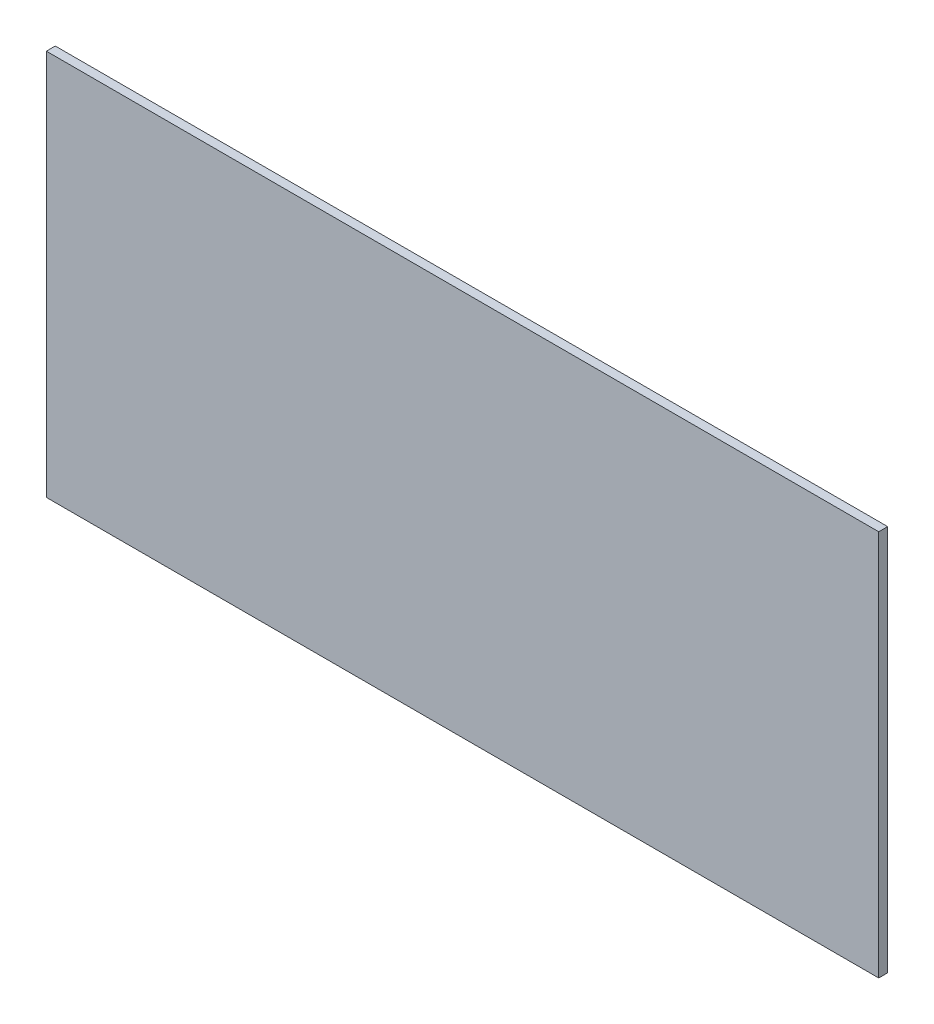
ISO-10303-21;
HEADER;
FILE_DESCRIPTION(('STEP AP214'),'2;1');
FILE_NAME('part.step','',(''),(''),'','','');
FILE_SCHEMA(('AUTOMOTIVE_DESIGN { 1 0 10303 214 1 1 1 1 }'));
ENDSEC;
DATA;
#1=APPLICATION_CONTEXT('core data for automotive mechanical design processes');
#2=APPLICATION_PROTOCOL_DEFINITION('international standard','automotive_design',2000,#1);
#3=PRODUCT_CONTEXT('',#1,'mechanical');
#4=PRODUCT('Part','Part','',(#3));
#5=PRODUCT_RELATED_PRODUCT_CATEGORY('part','',(#4));
#6=PRODUCT_DEFINITION_FORMATION('','',#4);
#7=PRODUCT_DEFINITION_CONTEXT('part definition',#1,'design');
#8=PRODUCT_DEFINITION('design','',#6,#7);
#9=PRODUCT_DEFINITION_SHAPE('','',#8);
#10=(LENGTH_UNIT() NAMED_UNIT(*) SI_UNIT(.MILLI.,.METRE.));
#11=(NAMED_UNIT(*) PLANE_ANGLE_UNIT() SI_UNIT($,.RADIAN.));
#12=(NAMED_UNIT(*) SI_UNIT($,.STERADIAN.) SOLID_ANGLE_UNIT());
#13=UNCERTAINTY_MEASURE_WITH_UNIT(LENGTH_MEASURE(1.E-05),#10,'distance_accuracy_value','');
#14=(GEOMETRIC_REPRESENTATION_CONTEXT(3) GLOBAL_UNCERTAINTY_ASSIGNED_CONTEXT((#13)) GLOBAL_UNIT_ASSIGNED_CONTEXT((#10,
#11,#12)) REPRESENTATION_CONTEXT('',''));
#15=CARTESIAN_POINT('',(0.,0.,0.));
#16=DIRECTION('',(0.,0.,1.));
#17=DIRECTION('',(1.,0.,0.));
#18=AXIS2_PLACEMENT_3D('',#15,#16,#17);
#19=CARTESIAN_POINT('',(-140.,643.088839573787,-3.));
#20=DIRECTION('',(0.,-1.,0.));
#21=DIRECTION('',(0.,0.,-1.));
#22=AXIS2_PLACEMENT_3D('',#19,#20,#21);
#23=PLANE('',#22);
#24=DIRECTION('',(1.,0.,0.));
#25=VECTOR('',#24,1.);
#26=CARTESIAN_POINT('',(-140.,643.088839573787,0.));
#27=LINE('',#26,#25);
#28=CARTESIAN_POINT('',(-140.,643.088839573787,0.));
#29=VERTEX_POINT('',#28);
#30=CARTESIAN_POINT('',(140.,643.088839573787,0.));
#31=VERTEX_POINT('',#30);
#32=EDGE_CURVE('E98',#29,#31,#27,.T.);
#33=ORIENTED_EDGE('',*,*,#32,.F.);
#34=DIRECTION('',(0.,0.,1.));
#35=VECTOR('',#34,1.);
#36=CARTESIAN_POINT('',(-140.,643.088839573787,-3.));
#37=LINE('',#36,#35);
#38=CARTESIAN_POINT('',(-140.,643.088839573787,-3.));
#39=VERTEX_POINT('',#38);
#40=EDGE_CURVE('E11',#39,#29,#37,.T.);
#41=ORIENTED_EDGE('',*,*,#40,.F.);
#42=DIRECTION('',(1.,0.,0.));
#43=VECTOR('',#42,1.);
#44=CARTESIAN_POINT('',(-140.,643.088839573787,-3.));
#45=LINE('',#44,#43);
#46=CARTESIAN_POINT('',(140.,643.088839573787,-3.));
#47=VERTEX_POINT('',#46);
#48=EDGE_CURVE('E92',#39,#47,#45,.T.);
#49=ORIENTED_EDGE('',*,*,#48,.T.);
#50=DIRECTION('',(0.,0.,1.));
#51=VECTOR('',#50,1.);
#52=CARTESIAN_POINT('',(140.,643.088839573787,-3.));
#53=LINE('',#52,#51);
#54=EDGE_CURVE('E37',#47,#31,#53,.T.);
#55=ORIENTED_EDGE('',*,*,#54,.T.);
#56=EDGE_LOOP('',(#33,#41,#49,#55));
#57=FACE_BOUND('',#56,.T.);
#58=ADVANCED_FACE('F34',(#57),#23,.T.);
#59=CARTESIAN_POINT('',(-140.,773.088839573787,-3.));
#60=DIRECTION('',(-1.,0.,0.));
#61=DIRECTION('',(0.,-1.,0.));
#62=AXIS2_PLACEMENT_3D('',#59,#60,#61);
#63=PLANE('',#62);
#64=DIRECTION('',(0.,-1.,0.));
#65=VECTOR('',#64,1.);
#66=CARTESIAN_POINT('',(-140.,773.088839573787,0.));
#67=LINE('',#66,#65);
#68=CARTESIAN_POINT('',(-140.,773.088839573787,0.));
#69=VERTEX_POINT('',#68);
#70=EDGE_CURVE('E94',#69,#29,#67,.T.);
#71=ORIENTED_EDGE('',*,*,#70,.F.);
#72=DIRECTION('',(0.,0.,1.));
#73=VECTOR('',#72,1.);
#74=CARTESIAN_POINT('',(-140.,773.088839573787,-3.));
#75=LINE('',#74,#73);
#76=CARTESIAN_POINT('',(-140.,773.088839573787,-3.));
#77=VERTEX_POINT('',#76);
#78=EDGE_CURVE('E43',#77,#69,#75,.T.);
#79=ORIENTED_EDGE('',*,*,#78,.F.);
#80=DIRECTION('',(0.,-1.,0.));
#81=VECTOR('',#80,1.);
#82=CARTESIAN_POINT('',(-140.,773.088839573787,-3.));
#83=LINE('',#82,#81);
#84=EDGE_CURVE('E89',#77,#39,#83,.T.);
#85=ORIENTED_EDGE('',*,*,#84,.T.);
#86=ORIENTED_EDGE('',*,*,#40,.T.);
#87=EDGE_LOOP('',(#71,#79,#85,#86));
#88=FACE_BOUND('',#87,.T.);
#89=ADVANCED_FACE('F108',(#88),#63,.T.);
#90=CARTESIAN_POINT('',(140.,773.088839573787,-3.));
#91=DIRECTION('',(0.,1.,0.));
#92=DIRECTION('',(0.,0.,1.));
#93=AXIS2_PLACEMENT_3D('',#90,#91,#92);
#94=PLANE('',#93);
#95=DIRECTION('',(-1.,0.,0.));
#96=VECTOR('',#95,1.);
#97=CARTESIAN_POINT('',(140.,773.088839573787,0.));
#98=LINE('',#97,#96);
#99=CARTESIAN_POINT('',(140.,773.088839573787,0.));
#100=VERTEX_POINT('',#99);
#101=EDGE_CURVE('E84',#100,#69,#98,.T.);
#102=ORIENTED_EDGE('',*,*,#101,.F.);
#103=DIRECTION('',(0.,0.,1.));
#104=VECTOR('',#103,1.);
#105=CARTESIAN_POINT('',(140.,773.088839573787,-3.));
#106=LINE('',#105,#104);
#107=CARTESIAN_POINT('',(140.,773.088839573787,-3.));
#108=VERTEX_POINT('',#107);
#109=EDGE_CURVE('E79',#108,#100,#106,.T.);
#110=ORIENTED_EDGE('',*,*,#109,.F.);
#111=DIRECTION('',(-1.,0.,0.));
#112=VECTOR('',#111,1.);
#113=CARTESIAN_POINT('',(140.,773.088839573787,-3.));
#114=LINE('',#113,#112);
#115=EDGE_CURVE('E82',#108,#77,#114,.T.);
#116=ORIENTED_EDGE('',*,*,#115,.T.);
#117=ORIENTED_EDGE('',*,*,#78,.T.);
#118=EDGE_LOOP('',(#102,#110,#116,#117));
#119=FACE_BOUND('',#118,.T.);
#120=ADVANCED_FACE('F81',(#119),#94,.T.);
#121=CARTESIAN_POINT('',(140.,643.088839573787,-3.));
#122=DIRECTION('',(1.,0.,0.));
#123=DIRECTION('',(0.,1.,0.));
#124=AXIS2_PLACEMENT_3D('',#121,#122,#123);
#125=PLANE('',#124);
#126=DIRECTION('',(0.,1.,0.));
#127=VECTOR('',#126,1.);
#128=CARTESIAN_POINT('',(140.,643.088839573787,0.));
#129=LINE('',#128,#127);
#130=EDGE_CURVE('E101',#31,#100,#129,.T.);
#131=ORIENTED_EDGE('',*,*,#130,.F.);
#132=ORIENTED_EDGE('',*,*,#54,.F.);
#133=DIRECTION('',(0.,1.,0.));
#134=VECTOR('',#133,1.);
#135=CARTESIAN_POINT('',(140.,643.088839573787,-3.));
#136=LINE('',#135,#134);
#137=EDGE_CURVE('E88',#47,#108,#136,.T.);
#138=ORIENTED_EDGE('',*,*,#137,.T.);
#139=ORIENTED_EDGE('',*,*,#109,.T.);
#140=EDGE_LOOP('',(#131,#132,#138,#139));
#141=FACE_BOUND('',#140,.T.);
#142=ADVANCED_FACE('F91',(#141),#125,.T.);
#143=CARTESIAN_POINT('',(0.,0.,-3.));
#144=DIRECTION('',(0.,0.,1.));
#145=DIRECTION('',(1.,0.,0.));
#146=AXIS2_PLACEMENT_3D('',#143,#144,#145);
#147=PLANE('',#146);
#148=ORIENTED_EDGE('',*,*,#48,.F.);
#149=ORIENTED_EDGE('',*,*,#84,.F.);
#150=ORIENTED_EDGE('',*,*,#115,.F.);
#151=ORIENTED_EDGE('',*,*,#137,.F.);
#152=EDGE_LOOP('',(#148,#149,#150,#151));
#153=FACE_BOUND('',#152,.T.);
#154=ADVANCED_FACE('F87',(#153),#147,.F.);
#155=CARTESIAN_POINT('',(0.,0.,0.));
#156=DIRECTION('',(0.,0.,1.));
#157=DIRECTION('',(1.,0.,0.));
#158=AXIS2_PLACEMENT_3D('',#155,#156,#157);
#159=PLANE('',#158);
#160=ORIENTED_EDGE('',*,*,#32,.T.);
#161=ORIENTED_EDGE('',*,*,#130,.T.);
#162=ORIENTED_EDGE('',*,*,#101,.T.);
#163=ORIENTED_EDGE('',*,*,#70,.T.);
#164=EDGE_LOOP('',(#160,#161,#162,#163));
#165=FACE_BOUND('',#164,.T.);
#166=ADVANCED_FACE('F107',(#165),#159,.T.);
#167=CLOSED_SHELL('',(#58,#89,#120,#142,#154,#166));
#168=MANIFOLD_SOLID_BREP('B2',#167);
#169=ADVANCED_BREP_SHAPE_REPRESENTATION('',(#18,#168),#14);
#170=SHAPE_DEFINITION_REPRESENTATION(#9,#169);
ENDSEC;
END-ISO-10303-21;
